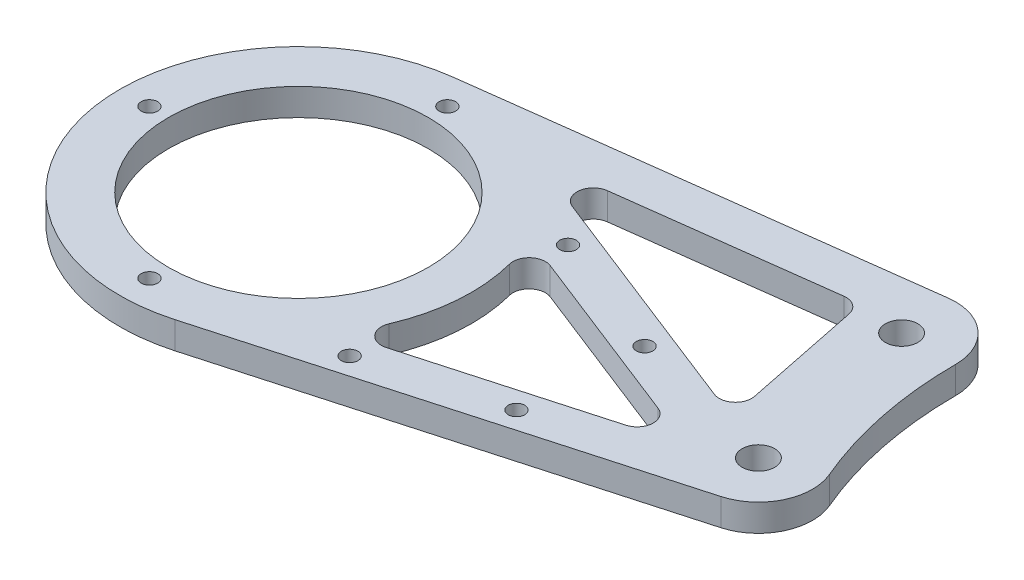
ISO-10303-21;
HEADER;
FILE_DESCRIPTION(('STEP AP214'),'2;1');
FILE_NAME('part.step','',(''),(''),'','','');
FILE_SCHEMA(('AUTOMOTIVE_DESIGN { 1 0 10303 214 1 1 1 1 }'));
ENDSEC;
DATA;
#1=APPLICATION_CONTEXT('core data for automotive mechanical design processes');
#2=APPLICATION_PROTOCOL_DEFINITION('international standard','automotive_design',2000,#1);
#3=PRODUCT_CONTEXT('',#1,'mechanical');
#4=PRODUCT('Part','Part','',(#3));
#5=PRODUCT_RELATED_PRODUCT_CATEGORY('part','',(#4));
#6=PRODUCT_DEFINITION_FORMATION('','',#4);
#7=PRODUCT_DEFINITION_CONTEXT('part definition',#1,'design');
#8=PRODUCT_DEFINITION('design','',#6,#7);
#9=PRODUCT_DEFINITION_SHAPE('','',#8);
#10=(LENGTH_UNIT() NAMED_UNIT(*) SI_UNIT(.MILLI.,.METRE.));
#11=(NAMED_UNIT(*) PLANE_ANGLE_UNIT() SI_UNIT($,.RADIAN.));
#12=(NAMED_UNIT(*) SI_UNIT($,.STERADIAN.) SOLID_ANGLE_UNIT());
#13=UNCERTAINTY_MEASURE_WITH_UNIT(LENGTH_MEASURE(1.E-05),#10,'distance_accuracy_value','');
#14=(GEOMETRIC_REPRESENTATION_CONTEXT(3) GLOBAL_UNCERTAINTY_ASSIGNED_CONTEXT((#13)) GLOBAL_UNIT_ASSIGNED_CONTEXT((#10,
#11,#12)) REPRESENTATION_CONTEXT('',''));
#15=CARTESIAN_POINT('',(0.,0.,0.));
#16=DIRECTION('',(0.,0.,1.));
#17=DIRECTION('',(1.,0.,0.));
#18=AXIS2_PLACEMENT_3D('',#15,#16,#17);
#19=CARTESIAN_POINT('',(0.,5.,0.));
#20=DIRECTION('',(0.,1.,0.));
#21=DIRECTION('',(0.,0.,1.));
#22=AXIS2_PLACEMENT_3D('',#19,#20,#21);
#23=PLANE('',#22);
#24=CARTESIAN_POINT('',(0.,5.,-27.5221634078138));
#25=DIRECTION('',(0.,1.,0.));
#26=DIRECTION('',(0.,0.,1.));
#27=AXIS2_PLACEMENT_3D('',#24,#25,#26);
#28=CIRCLE('',#27,1.525);
#29=CARTESIAN_POINT('',(0.,5.,-25.9971634078138));
#30=VERTEX_POINT('',#29);
#31=EDGE_CURVE('E363',#30,#30,#28,.T.);
#32=ORIENTED_EDGE('',*,*,#31,.F.);
#33=EDGE_LOOP('',(#32));
#34=FACE_BOUND('',#33,.T.);
#35=CARTESIAN_POINT('',(33.3215348622938,5.,-16.496811603075));
#36=DIRECTION('',(0.,1.,0.));
#37=DIRECTION('',(0.,0.,1.));
#38=AXIS2_PLACEMENT_3D('',#35,#36,#37);
#39=CIRCLE('',#38,1.525);
#40=CARTESIAN_POINT('',(33.3215348622938,5.,-14.971811603075));
#41=VERTEX_POINT('',#40);
#42=EDGE_CURVE('E366',#41,#41,#39,.T.);
#43=ORIENTED_EDGE('',*,*,#42,.F.);
#44=EDGE_LOOP('',(#43));
#45=FACE_BOUND('',#44,.T.);
#46=CARTESIAN_POINT('',(-27.5221634078138,5.,0.));
#47=DIRECTION('',(0.,1.,0.));
#48=DIRECTION('',(0.,0.,1.));
#49=AXIS2_PLACEMENT_3D('',#46,#47,#48);
#50=CIRCLE('',#49,1.525);
#51=CARTESIAN_POINT('',(-27.5221634078138,5.,1.525));
#52=VERTEX_POINT('',#51);
#53=EDGE_CURVE('E369',#52,#52,#50,.T.);
#54=ORIENTED_EDGE('',*,*,#53,.F.);
#55=EDGE_LOOP('',(#54));
#56=FACE_BOUND('',#55,.T.);
#57=CARTESIAN_POINT('',(0.,5.,27.5221634078138));
#58=DIRECTION('',(0.,1.,0.));
#59=DIRECTION('',(0.,0.,1.));
#60=AXIS2_PLACEMENT_3D('',#57,#58,#59);
#61=CIRCLE('',#60,1.525);
#62=CARTESIAN_POINT('',(0.,5.,29.0471634078138));
#63=VERTEX_POINT('',#62);
#64=EDGE_CURVE('E372',#63,#63,#61,.T.);
#65=ORIENTED_EDGE('',*,*,#64,.F.);
#66=EDGE_LOOP('',(#65));
#67=FACE_BOUND('',#66,.T.);
#68=CARTESIAN_POINT('',(30.9017025254333,5.,21.4381076218142));
#69=DIRECTION('',(0.,1.,0.));
#70=DIRECTION('',(0.,0.,1.));
#71=AXIS2_PLACEMENT_3D('',#68,#69,#70);
#72=CIRCLE('',#71,1.52499999999999);
#73=CARTESIAN_POINT('',(30.9017025254333,5.,22.9631076218142));
#74=VERTEX_POINT('',#73);
#75=EDGE_CURVE('E375',#74,#74,#72,.T.);
#76=ORIENTED_EDGE('',*,*,#75,.F.);
#77=EDGE_LOOP('',(#76));
#78=FACE_BOUND('',#77,.T.);
#79=CARTESIAN_POINT('',(56.596303963621,5.,-7.3707432667154));
#80=DIRECTION('',(0.,1.,0.));
#81=DIRECTION('',(0.,0.,1.));
#82=AXIS2_PLACEMENT_3D('',#79,#80,#81);
#83=CIRCLE('',#82,1.525);
#84=CARTESIAN_POINT('',(56.596303963621,5.,-5.84574326671541));
#85=VERTEX_POINT('',#84);
#86=EDGE_CURVE('E378',#85,#85,#83,.T.);
#87=ORIENTED_EDGE('',*,*,#86,.F.);
#88=EDGE_LOOP('',(#87));
#89=FACE_BOUND('',#88,.T.);
#90=CARTESIAN_POINT('',(54.9690819907024,5.,14.6734017394612));
#91=DIRECTION('',(0.,1.,0.));
#92=DIRECTION('',(0.,0.,1.));
#93=AXIS2_PLACEMENT_3D('',#90,#91,#92);
#94=CIRCLE('',#93,1.525);
#95=CARTESIAN_POINT('',(54.9690819907024,5.,16.1984017394612));
#96=VERTEX_POINT('',#95);
#97=EDGE_CURVE('E381',#96,#96,#94,.T.);
#98=ORIENTED_EDGE('',*,*,#97,.F.);
#99=EDGE_LOOP('',(#98));
#100=FACE_BOUND('',#99,.T.);
#101=CARTESIAN_POINT('',(0.,5.,0.));
#102=DIRECTION('',(0.,1.,0.));
#103=DIRECTION('',(0.,0.,1.));
#104=AXIS2_PLACEMENT_3D('',#101,#102,#103);
#105=CIRCLE('',#104,24.);
#106=CARTESIAN_POINT('',(0.,5.,24.));
#107=VERTEX_POINT('',#106);
#108=EDGE_CURVE('E213',#107,#107,#105,.T.);
#109=ORIENTED_EDGE('',*,*,#108,.F.);
#110=EDGE_LOOP('',(#109));
#111=FACE_BOUND('',#110,.T.);
#112=CARTESIAN_POINT('',(163.242912543457,5.,-33.2121459215883));
#113=DIRECTION('',(0.,1.,0.));
#114=DIRECTION('',(0.,0.,1.));
#115=AXIS2_PLACEMENT_3D('',#112,#113,#114);
#116=CIRCLE('',#115,75.);
#117=CARTESIAN_POINT('',(88.2429125434574,5.,-33.2121459215884));
#118=VERTEX_POINT('',#117);
#119=CARTESIAN_POINT('',(94.2050485345244,5.,-3.90731128489274));
#120=VERTEX_POINT('',#119);
#121=EDGE_CURVE('E186',#118,#120,#116,.T.);
#122=ORIENTED_EDGE('',*,*,#121,.F.);
#123=CARTESIAN_POINT('',(78.2429125434574,5.,-33.2121459215884));
#124=DIRECTION('',(0.,1.,0.));
#125=DIRECTION('',(0.,0.,1.));
#126=AXIS2_PLACEMENT_3D('',#123,#124,#125);
#127=CIRCLE('',#126,9.99999999999999);
#128=CARTESIAN_POINT('',(76.9721406469134,5.,-43.131074229977));
#129=VERTEX_POINT('',#128);
#130=EDGE_CURVE('E196',#118,#129,#127,.T.);
#131=ORIENTED_EDGE('',*,*,#130,.T.);
#132=DIRECTION('',(0.991892830838866,0.,-0.127077189654403));
#133=VECTOR('',#132,1.);
#134=CARTESIAN_POINT('',(-4.19354725859528,5.,-32.7324634176826));
#135=LINE('',#134,#133);
#136=CARTESIAN_POINT('',(-4.19354725859528,5.,-32.7324634176826));
#137=VERTEX_POINT('',#136);
#138=EDGE_CURVE('E201',#137,#129,#135,.T.);
#139=ORIENTED_EDGE('',*,*,#138,.F.);
#140=CARTESIAN_POINT('',(0.,5.,0.));
#141=DIRECTION('',(0.,1.,0.));
#142=DIRECTION('',(0.,0.,1.));
#143=AXIS2_PLACEMENT_3D('',#140,#141,#142);
#144=CIRCLE('',#143,33.);
#145=CARTESIAN_POINT('',(8.92941176470588,5.,31.7689408941553));
#146=VERTEX_POINT('',#145);
#147=EDGE_CURVE('E217',#137,#146,#144,.T.);
#148=ORIENTED_EDGE('',*,*,#147,.T.);
#149=DIRECTION('',(0.962695178610766,0.,-0.270588235294118));
#150=VECTOR('',#149,1.);
#151=CARTESIAN_POINT('',(8.92941176470588,5.,31.7689408941553));
#152=LINE('',#151,#150);
#153=CARTESIAN_POINT('',(87.7058823529412,5.,9.62695178610766));
#154=VERTEX_POINT('',#153);
#155=EDGE_CURVE('E219',#146,#154,#152,.T.);
#156=ORIENTED_EDGE('',*,*,#155,.T.);
#157=CARTESIAN_POINT('',(85.,5.,0.));
#158=DIRECTION('',(0.,1.,0.));
#159=DIRECTION('',(0.,0.,1.));
#160=AXIS2_PLACEMENT_3D('',#157,#158,#159);
#161=CIRCLE('',#160,9.99999999999999);
#162=EDGE_CURVE('E205',#154,#120,#161,.T.);
#163=ORIENTED_EDGE('',*,*,#162,.T.);
#164=EDGE_LOOP('',(#122,#131,#139,#148,#156,#163));
#165=FACE_BOUND('',#164,.T.);
#166=CARTESIAN_POINT('',(85.,5.,0.));
#167=DIRECTION('',(0.,1.,0.));
#168=DIRECTION('',(0.,0.,1.));
#169=AXIS2_PLACEMENT_3D('',#166,#167,#168);
#170=CIRCLE('',#169,3.00000000000001);
#171=CARTESIAN_POINT('',(85.,5.,3.00000000000001));
#172=VERTEX_POINT('',#171);
#173=EDGE_CURVE('E222',#172,#172,#170,.T.);
#174=ORIENTED_EDGE('',*,*,#173,.F.);
#175=EDGE_LOOP('',(#174));
#176=FACE_BOUND('',#175,.T.);
#177=CARTESIAN_POINT('',(78.2429125434574,5.,-33.2121459215884));
#178=DIRECTION('',(0.,1.,0.));
#179=DIRECTION('',(0.,0.,1.));
#180=AXIS2_PLACEMENT_3D('',#177,#178,#179);
#181=CIRCLE('',#180,3.00000000000002);
#182=CARTESIAN_POINT('',(78.2429125434574,5.,-30.2121459215883));
#183=VERTEX_POINT('',#182);
#184=EDGE_CURVE('E225',#183,#183,#181,.T.);
#185=ORIENTED_EDGE('',*,*,#184,.F.);
#186=EDGE_LOOP('',(#185));
#187=FACE_BOUND('',#186,.T.);
#188=DIRECTION('',(-0.930990764053088,0.,-0.365042733454383));
#189=VECTOR('',#188,1.);
#190=CARTESIAN_POINT('',(11.5069366947841,5.,-29.3468429956469));
#191=LINE('',#190,#189);
#192=CARTESIAN_POINT('',(70.7471802784156,5.,-6.11866363742589));
#193=VERTEX_POINT('',#192);
#194=CARTESIAN_POINT('',(27.5492275878876,5.,-23.056639113286));
#195=VERTEX_POINT('',#194);
#196=EDGE_CURVE('E324',#193,#195,#191,.T.);
#197=ORIENTED_EDGE('',*,*,#196,.T.);
#198=CARTESIAN_POINT('',(28.6443557882508,5.,-25.8496114054452));
#199=DIRECTION('',(0.,1.,0.));
#200=DIRECTION('',(0.,0.,1.));
#201=AXIS2_PLACEMENT_3D('',#198,#199,#200);
#202=CIRCLE('',#201,3.);
#203=CARTESIAN_POINT('',(28.2631242192876,5.,-28.8252898979618));
#204=VERTEX_POINT('',#203);
#205=EDGE_CURVE('E315',#195,#204,#202,.F.);
#206=ORIENTED_EDGE('',*,*,#205,.T.);
#207=DIRECTION('',(0.991892830838866,0.,-0.127077189654402));
#208=VECTOR('',#207,1.);
#209=CARTESIAN_POINT('',(-3.17692974136006,5.,-24.7973207709716));
#210=LINE('',#209,#208);
#211=CARTESIAN_POINT('',(67.0051772793221,5.,-33.7887608206695));
#212=VERTEX_POINT('',#211);
#213=EDGE_CURVE('E330',#204,#212,#210,.T.);
#214=ORIENTED_EDGE('',*,*,#213,.T.);
#215=CARTESIAN_POINT('',(67.3864088482853,5.,-30.8130823281529));
#216=DIRECTION('',(0.,1.,0.));
#217=DIRECTION('',(0.,0.,1.));
#218=AXIS2_PLACEMENT_3D('',#215,#216,#217);
#219=CIRCLE('',#218,3.);
#220=CARTESIAN_POINT('',(70.3261829621477,5.,-31.4111861314045));
#221=VERTEX_POINT('',#220);
#222=EDGE_CURVE('E79',#212,#221,#219,.F.);
#223=ORIENTED_EDGE('',*,*,#222,.T.);
#224=DIRECTION('',(0.199367934417198,0.,0.979924704620829));
#225=VECTOR('',#224,1.);
#226=CARTESIAN_POINT('',(73.6675519539497,5.,-14.9878328379459));
#227=LINE('',#226,#225);
#228=CARTESIAN_POINT('',(74.7820825926413,5.,-9.50973973283677));
#229=VERTEX_POINT('',#228);
#230=EDGE_CURVE('E325',#221,#229,#227,.T.);
#231=ORIENTED_EDGE('',*,*,#230,.T.);
#232=CARTESIAN_POINT('',(71.8423084787788,5.,-8.91163592958517));
#233=DIRECTION('',(0.,1.,0.));
#234=DIRECTION('',(0.,0.,1.));
#235=AXIS2_PLACEMENT_3D('',#232,#233,#234);
#236=CIRCLE('',#235,3.);
#237=EDGE_CURVE('E65',#229,#193,#236,.F.);
#238=ORIENTED_EDGE('',*,*,#237,.T.);
#239=EDGE_LOOP('',(#197,#206,#214,#223,#231,#238));
#240=FACE_BOUND('',#239,.T.);
#241=DIRECTION('',(0.962695178610766,0.,-0.270588235294118));
#242=VECTOR('',#241,1.);
#243=CARTESIAN_POINT('',(6.76470588235294,5.,24.0673794652692));
#244=LINE('',#243,#242);
#245=CARTESIAN_POINT('',(32.9705347593037,5.,16.7016118289686));
#246=VERTEX_POINT('',#245);
#247=CARTESIAN_POINT('',(67.5044798398151,5.,6.99503028093982));
#248=VERTEX_POINT('',#247);
#249=EDGE_CURVE('E357',#246,#248,#244,.T.);
#250=ORIENTED_EDGE('',*,*,#249,.F.);
#251=CARTESIAN_POINT('',(32.1587700534214,5.,13.8135262931363));
#252=DIRECTION('',(0.,1.,0.));
#253=DIRECTION('',(0.,0.,1.));
#254=AXIS2_PLACEMENT_3D('',#251,#252,#253);
#255=CIRCLE('',#254,3.);
#256=CARTESIAN_POINT('',(29.4023040488424,5.,12.6295097537246));
#257=VERTEX_POINT('',#256);
#258=EDGE_CURVE('E311',#246,#257,#255,.F.);
#259=ORIENTED_EDGE('',*,*,#258,.T.);
#260=CARTESIAN_POINT('',(0.,5.,0.));
#261=DIRECTION('',(0.,1.,0.));
#262=DIRECTION('',(0.,0.,1.));
#263=AXIS2_PLACEMENT_3D('',#260,#261,#262);
#264=CIRCLE('',#263,32.);
#265=CARTESIAN_POINT('',(30.9823975337499,5.,-8.0056881690889));
#266=VERTEX_POINT('',#265);
#267=EDGE_CURVE('E360',#257,#266,#264,.T.);
#268=ORIENTED_EDGE('',*,*,#267,.T.);
#269=CARTESIAN_POINT('',(33.8869973025389,5.,-8.75622143494099));
#270=DIRECTION('',(0.,1.,0.));
#271=DIRECTION('',(0.,0.,1.));
#272=AXIS2_PLACEMENT_3D('',#269,#270,#271);
#273=CIRCLE('',#272,3.);
#274=CARTESIAN_POINT('',(34.9821255029021,5.,-11.5491937271002));
#275=VERTEX_POINT('',#274);
#276=EDGE_CURVE('E303',#266,#275,#273,.F.);
#277=ORIENTED_EDGE('',*,*,#276,.T.);
#278=DIRECTION('',(0.930990764053088,0.,0.365042733454383));
#279=VECTOR('',#278,1.);
#280=CARTESIAN_POINT('',(8.58659482714902,5.,-21.8989168832222));
#281=LINE('',#280,#279);
#282=CARTESIAN_POINT('',(67.7878433342959,5.,1.31397245294826));
#283=VERTEX_POINT('',#282);
#284=EDGE_CURVE('E352',#275,#283,#281,.T.);
#285=ORIENTED_EDGE('',*,*,#284,.T.);
#286=CARTESIAN_POINT('',(66.6927151339328,5.,4.10694474510753));
#287=DIRECTION('',(0.,1.,0.));
#288=DIRECTION('',(0.,0.,1.));
#289=AXIS2_PLACEMENT_3D('',#286,#287,#288);
#290=CIRCLE('',#289,3.);
#291=EDGE_CURVE('E307',#283,#248,#290,.F.);
#292=ORIENTED_EDGE('',*,*,#291,.T.);
#293=EDGE_LOOP('',(#250,#259,#268,#277,#285,#292));
#294=FACE_BOUND('',#293,.T.);
#295=ADVANCED_FACE('F57',(#34,#45,#56,#67,#78,#89,#100,#111,#165,#176,#187,#240,#294),#23,.T.);
#296=CARTESIAN_POINT('',(0.,0.,0.));
#297=DIRECTION('',(0.,1.,0.));
#298=DIRECTION('',(0.,0.,1.));
#299=AXIS2_PLACEMENT_3D('',#296,#297,#298);
#300=PLANE('',#299);
#301=CARTESIAN_POINT('',(0.,0.,-27.5221634078138));
#302=DIRECTION('',(0.,-1.,0.));
#303=DIRECTION('',(0.,0.,-1.));
#304=AXIS2_PLACEMENT_3D('',#301,#302,#303);
#305=CIRCLE('',#304,1.525);
#306=CARTESIAN_POINT('',(0.,0.,-29.0471634078138));
#307=VERTEX_POINT('',#306);
#308=EDGE_CURVE('E384',#307,#307,#305,.T.);
#309=ORIENTED_EDGE('',*,*,#308,.F.);
#310=EDGE_LOOP('',(#309));
#311=FACE_BOUND('',#310,.T.);
#312=CARTESIAN_POINT('',(33.3215348622938,0.,-16.496811603075));
#313=DIRECTION('',(0.,-1.,0.));
#314=DIRECTION('',(0.,0.,-1.));
#315=AXIS2_PLACEMENT_3D('',#312,#313,#314);
#316=CIRCLE('',#315,1.525);
#317=CARTESIAN_POINT('',(33.3215348622938,0.,-18.021811603075));
#318=VERTEX_POINT('',#317);
#319=EDGE_CURVE('E400',#318,#318,#316,.T.);
#320=ORIENTED_EDGE('',*,*,#319,.F.);
#321=EDGE_LOOP('',(#320));
#322=FACE_BOUND('',#321,.T.);
#323=CARTESIAN_POINT('',(-27.5221634078138,0.,0.));
#324=DIRECTION('',(0.,-1.,0.));
#325=DIRECTION('',(0.,0.,-1.));
#326=AXIS2_PLACEMENT_3D('',#323,#324,#325);
#327=CIRCLE('',#326,1.525);
#328=CARTESIAN_POINT('',(-27.5221634078138,0.,-1.525));
#329=VERTEX_POINT('',#328);
#330=EDGE_CURVE('E397',#329,#329,#327,.T.);
#331=ORIENTED_EDGE('',*,*,#330,.F.);
#332=EDGE_LOOP('',(#331));
#333=FACE_BOUND('',#332,.T.);
#334=CARTESIAN_POINT('',(0.,0.,27.5221634078138));
#335=DIRECTION('',(0.,-1.,0.));
#336=DIRECTION('',(0.,0.,-1.));
#337=AXIS2_PLACEMENT_3D('',#334,#335,#336);
#338=CIRCLE('',#337,1.525);
#339=CARTESIAN_POINT('',(0.,0.,25.9971634078138));
#340=VERTEX_POINT('',#339);
#341=EDGE_CURVE('E394',#340,#340,#338,.T.);
#342=ORIENTED_EDGE('',*,*,#341,.F.);
#343=EDGE_LOOP('',(#342));
#344=FACE_BOUND('',#343,.T.);
#345=CARTESIAN_POINT('',(30.9017025254333,0.,21.4381076218142));
#346=DIRECTION('',(0.,-1.,0.));
#347=DIRECTION('',(0.,0.,-1.));
#348=AXIS2_PLACEMENT_3D('',#345,#346,#347);
#349=CIRCLE('',#348,1.52499999999999);
#350=CARTESIAN_POINT('',(30.9017025254333,0.,19.9131076218142));
#351=VERTEX_POINT('',#350);
#352=EDGE_CURVE('E391',#351,#351,#349,.T.);
#353=ORIENTED_EDGE('',*,*,#352,.F.);
#354=EDGE_LOOP('',(#353));
#355=FACE_BOUND('',#354,.T.);
#356=CARTESIAN_POINT('',(56.596303963621,0.,-7.3707432667154));
#357=DIRECTION('',(0.,-1.,0.));
#358=DIRECTION('',(0.,0.,-1.));
#359=AXIS2_PLACEMENT_3D('',#356,#357,#358);
#360=CIRCLE('',#359,1.525);
#361=CARTESIAN_POINT('',(56.596303963621,0.,-8.8957432667154));
#362=VERTEX_POINT('',#361);
#363=EDGE_CURVE('E388',#362,#362,#360,.T.);
#364=ORIENTED_EDGE('',*,*,#363,.F.);
#365=EDGE_LOOP('',(#364));
#366=FACE_BOUND('',#365,.T.);
#367=CARTESIAN_POINT('',(54.9690819907024,0.,14.6734017394612));
#368=DIRECTION('',(0.,-1.,0.));
#369=DIRECTION('',(0.,0.,-1.));
#370=AXIS2_PLACEMENT_3D('',#367,#368,#369);
#371=CIRCLE('',#370,1.525);
#372=CARTESIAN_POINT('',(54.9690819907024,0.,13.1484017394612));
#373=VERTEX_POINT('',#372);
#374=EDGE_CURVE('E385',#373,#373,#371,.T.);
#375=ORIENTED_EDGE('',*,*,#374,.F.);
#376=EDGE_LOOP('',(#375));
#377=FACE_BOUND('',#376,.T.);
#378=DIRECTION('',(0.199367934417198,0.,0.979924704620829));
#379=VECTOR('',#378,1.);
#380=CARTESIAN_POINT('',(73.6675519539497,0.,-14.9878328379459));
#381=LINE('',#380,#379);
#382=CARTESIAN_POINT('',(70.3261829621477,0.,-31.4111861314045));
#383=VERTEX_POINT('',#382);
#384=CARTESIAN_POINT('',(74.7820825926413,0.,-9.50973973283677));
#385=VERTEX_POINT('',#384);
#386=EDGE_CURVE('E262',#383,#385,#381,.T.);
#387=ORIENTED_EDGE('',*,*,#386,.F.);
#388=CARTESIAN_POINT('',(67.3864088482853,0.,-30.8130823281529));
#389=DIRECTION('',(0.,1.,0.));
#390=DIRECTION('',(0.,0.,1.));
#391=AXIS2_PLACEMENT_3D('',#388,#389,#390);
#392=CIRCLE('',#391,3.);
#393=CARTESIAN_POINT('',(67.0051772793221,0.,-33.7887608206695));
#394=VERTEX_POINT('',#393);
#395=EDGE_CURVE('E320',#383,#394,#392,.T.);
#396=ORIENTED_EDGE('',*,*,#395,.T.);
#397=DIRECTION('',(0.991892830838866,0.,-0.127077189654402));
#398=VECTOR('',#397,1.);
#399=CARTESIAN_POINT('',(-3.17692974136006,0.,-24.7973207709716));
#400=LINE('',#399,#398);
#401=CARTESIAN_POINT('',(28.2631242192876,0.,-28.8252898979618));
#402=VERTEX_POINT('',#401);
#403=EDGE_CURVE('E192',#402,#394,#400,.T.);
#404=ORIENTED_EDGE('',*,*,#403,.F.);
#405=CARTESIAN_POINT('',(28.6443557882508,0.,-25.8496114054452));
#406=DIRECTION('',(0.,1.,0.));
#407=DIRECTION('',(0.,0.,1.));
#408=AXIS2_PLACEMENT_3D('',#405,#406,#407);
#409=CIRCLE('',#408,3.);
#410=CARTESIAN_POINT('',(27.5492275878876,0.,-23.056639113286));
#411=VERTEX_POINT('',#410);
#412=EDGE_CURVE('E317',#402,#411,#409,.T.);
#413=ORIENTED_EDGE('',*,*,#412,.T.);
#414=DIRECTION('',(-0.930990764053088,0.,-0.365042733454383));
#415=VECTOR('',#414,1.);
#416=CARTESIAN_POINT('',(11.5069366947841,0.,-29.3468429956469));
#417=LINE('',#416,#415);
#418=CARTESIAN_POINT('',(70.7471802784156,0.,-6.11866363742589));
#419=VERTEX_POINT('',#418);
#420=EDGE_CURVE('E259',#419,#411,#417,.T.);
#421=ORIENTED_EDGE('',*,*,#420,.F.);
#422=CARTESIAN_POINT('',(71.8423084787788,0.,-8.91163592958517));
#423=DIRECTION('',(0.,1.,0.));
#424=DIRECTION('',(0.,0.,1.));
#425=AXIS2_PLACEMENT_3D('',#422,#423,#424);
#426=CIRCLE('',#425,3.);
#427=EDGE_CURVE('E12',#419,#385,#426,.T.);
#428=ORIENTED_EDGE('',*,*,#427,.T.);
#429=EDGE_LOOP('',(#387,#396,#404,#413,#421,#428));
#430=FACE_BOUND('',#429,.T.);
#431=CARTESIAN_POINT('',(0.,0.,0.));
#432=DIRECTION('',(0.,1.,0.));
#433=DIRECTION('',(0.,0.,1.));
#434=AXIS2_PLACEMENT_3D('',#431,#432,#433);
#435=CIRCLE('',#434,24.);
#436=CARTESIAN_POINT('',(0.,0.,24.));
#437=VERTEX_POINT('',#436);
#438=EDGE_CURVE('E231',#437,#437,#435,.T.);
#439=ORIENTED_EDGE('',*,*,#438,.T.);
#440=EDGE_LOOP('',(#439));
#441=FACE_BOUND('',#440,.T.);
#442=CARTESIAN_POINT('',(163.242912543457,0.,-33.2121459215883));
#443=DIRECTION('',(0.,1.,0.));
#444=DIRECTION('',(0.,0.,1.));
#445=AXIS2_PLACEMENT_3D('',#442,#443,#444);
#446=CIRCLE('',#445,75.);
#447=CARTESIAN_POINT('',(88.2429125434574,0.,-33.2121459215884));
#448=VERTEX_POINT('',#447);
#449=CARTESIAN_POINT('',(94.2050485345244,0.,-3.90731128489274));
#450=VERTEX_POINT('',#449);
#451=EDGE_CURVE('E188',#448,#450,#446,.T.);
#452=ORIENTED_EDGE('',*,*,#451,.T.);
#453=CARTESIAN_POINT('',(85.,0.,0.));
#454=DIRECTION('',(0.,1.,0.));
#455=DIRECTION('',(0.,0.,1.));
#456=AXIS2_PLACEMENT_3D('',#453,#454,#455);
#457=CIRCLE('',#456,9.99999999999999);
#458=CARTESIAN_POINT('',(87.7058823529412,0.,9.62695178610766));
#459=VERTEX_POINT('',#458);
#460=EDGE_CURVE('E240',#459,#450,#457,.T.);
#461=ORIENTED_EDGE('',*,*,#460,.F.);
#462=DIRECTION('',(0.962695178610766,0.,-0.270588235294118));
#463=VECTOR('',#462,1.);
#464=CARTESIAN_POINT('',(8.92941176470588,0.,31.7689408941553));
#465=LINE('',#464,#463);
#466=CARTESIAN_POINT('',(8.92941176470588,0.,31.7689408941553));
#467=VERTEX_POINT('',#466);
#468=EDGE_CURVE('E238',#467,#459,#465,.T.);
#469=ORIENTED_EDGE('',*,*,#468,.F.);
#470=CARTESIAN_POINT('',(0.,0.,0.));
#471=DIRECTION('',(0.,1.,0.));
#472=DIRECTION('',(0.,0.,1.));
#473=AXIS2_PLACEMENT_3D('',#470,#471,#472);
#474=CIRCLE('',#473,33.);
#475=CARTESIAN_POINT('',(-4.19354725859528,0.,-32.7324634176826));
#476=VERTEX_POINT('',#475);
#477=EDGE_CURVE('E236',#476,#467,#474,.T.);
#478=ORIENTED_EDGE('',*,*,#477,.F.);
#479=DIRECTION('',(0.991892830838866,0.,-0.127077189654403));
#480=VECTOR('',#479,1.);
#481=CARTESIAN_POINT('',(-4.19354725859528,0.,-32.7324634176826));
#482=LINE('',#481,#480);
#483=CARTESIAN_POINT('',(76.9721406469134,0.,-43.131074229977));
#484=VERTEX_POINT('',#483);
#485=EDGE_CURVE('E233',#476,#484,#482,.T.);
#486=ORIENTED_EDGE('',*,*,#485,.T.);
#487=CARTESIAN_POINT('',(78.2429125434574,0.,-33.2121459215884));
#488=DIRECTION('',(0.,1.,0.));
#489=DIRECTION('',(0.,0.,1.));
#490=AXIS2_PLACEMENT_3D('',#487,#488,#489);
#491=CIRCLE('',#490,9.99999999999999);
#492=EDGE_CURVE('E230',#448,#484,#491,.T.);
#493=ORIENTED_EDGE('',*,*,#492,.F.);
#494=EDGE_LOOP('',(#452,#461,#469,#478,#486,#493));
#495=FACE_BOUND('',#494,.T.);
#496=CARTESIAN_POINT('',(85.,0.,0.));
#497=DIRECTION('',(0.,1.,0.));
#498=DIRECTION('',(0.,0.,1.));
#499=AXIS2_PLACEMENT_3D('',#496,#497,#498);
#500=CIRCLE('',#499,3.00000000000001);
#501=CARTESIAN_POINT('',(85.,0.,3.00000000000001));
#502=VERTEX_POINT('',#501);
#503=EDGE_CURVE('E210',#502,#502,#500,.T.);
#504=ORIENTED_EDGE('',*,*,#503,.T.);
#505=EDGE_LOOP('',(#504));
#506=FACE_BOUND('',#505,.T.);
#507=CARTESIAN_POINT('',(78.2429125434574,0.,-33.2121459215884));
#508=DIRECTION('',(0.,1.,0.));
#509=DIRECTION('',(0.,0.,1.));
#510=AXIS2_PLACEMENT_3D('',#507,#508,#509);
#511=CIRCLE('',#510,3.00000000000002);
#512=CARTESIAN_POINT('',(78.2429125434574,0.,-30.2121459215883));
#513=VERTEX_POINT('',#512);
#514=EDGE_CURVE('E207',#513,#513,#511,.T.);
#515=ORIENTED_EDGE('',*,*,#514,.T.);
#516=EDGE_LOOP('',(#515));
#517=FACE_BOUND('',#516,.T.);
#518=CARTESIAN_POINT('',(0.,0.,0.));
#519=DIRECTION('',(0.,1.,0.));
#520=DIRECTION('',(0.,0.,1.));
#521=AXIS2_PLACEMENT_3D('',#518,#519,#520);
#522=CIRCLE('',#521,32.);
#523=CARTESIAN_POINT('',(29.4023040488424,0.,12.6295097537246));
#524=VERTEX_POINT('',#523);
#525=CARTESIAN_POINT('',(30.9823975337499,0.,-8.0056881690889));
#526=VERTEX_POINT('',#525);
#527=EDGE_CURVE('E271',#524,#526,#522,.T.);
#528=ORIENTED_EDGE('',*,*,#527,.F.);
#529=CARTESIAN_POINT('',(32.1587700534214,0.,13.8135262931363));
#530=DIRECTION('',(0.,1.,0.));
#531=DIRECTION('',(0.,0.,1.));
#532=AXIS2_PLACEMENT_3D('',#529,#530,#531);
#533=CIRCLE('',#532,3.);
#534=CARTESIAN_POINT('',(32.9705347593037,0.,16.7016118289686));
#535=VERTEX_POINT('',#534);
#536=EDGE_CURVE('E313',#524,#535,#533,.T.);
#537=ORIENTED_EDGE('',*,*,#536,.T.);
#538=DIRECTION('',(0.962695178610766,0.,-0.270588235294118));
#539=VECTOR('',#538,1.);
#540=CARTESIAN_POINT('',(6.76470588235294,0.,24.0673794652692));
#541=LINE('',#540,#539);
#542=CARTESIAN_POINT('',(67.5044798398151,0.,6.99503028093982));
#543=VERTEX_POINT('',#542);
#544=EDGE_CURVE('E265',#535,#543,#541,.T.);
#545=ORIENTED_EDGE('',*,*,#544,.T.);
#546=CARTESIAN_POINT('',(66.6927151339328,0.,4.10694474510753));
#547=DIRECTION('',(0.,1.,0.));
#548=DIRECTION('',(0.,0.,1.));
#549=AXIS2_PLACEMENT_3D('',#546,#547,#548);
#550=CIRCLE('',#549,3.);
#551=CARTESIAN_POINT('',(67.7878433342959,0.,1.31397245294826));
#552=VERTEX_POINT('',#551);
#553=EDGE_CURVE('E309',#543,#552,#550,.T.);
#554=ORIENTED_EDGE('',*,*,#553,.T.);
#555=DIRECTION('',(0.930990764053088,0.,0.365042733454383));
#556=VECTOR('',#555,1.);
#557=CARTESIAN_POINT('',(8.58659482714902,0.,-21.8989168832222));
#558=LINE('',#557,#556);
#559=CARTESIAN_POINT('',(34.9821255029021,0.,-11.5491937271002));
#560=VERTEX_POINT('',#559);
#561=EDGE_CURVE('E268',#560,#552,#558,.T.);
#562=ORIENTED_EDGE('',*,*,#561,.F.);
#563=CARTESIAN_POINT('',(33.8869973025389,0.,-8.75622143494099));
#564=DIRECTION('',(0.,1.,0.));
#565=DIRECTION('',(0.,0.,1.));
#566=AXIS2_PLACEMENT_3D('',#563,#564,#565);
#567=CIRCLE('',#566,3.);
#568=EDGE_CURVE('E305',#560,#526,#567,.T.);
#569=ORIENTED_EDGE('',*,*,#568,.T.);
#570=EDGE_LOOP('',(#528,#537,#545,#554,#562,#569));
#571=FACE_BOUND('',#570,.T.);
#572=ADVANCED_FACE('F334',(#311,#322,#333,#344,#355,#366,#377,#430,#441,#495,#506,#517,#571),
#300,.F.);
#573=CARTESIAN_POINT('',(163.242912543457,5.,-33.2121459215883));
#574=DIRECTION('',(0.,-1.,0.));
#575=DIRECTION('',(0.,0.,-1.));
#576=AXIS2_PLACEMENT_3D('',#573,#574,#575);
#577=CYLINDRICAL_SURFACE('',#576,75.);
#578=ORIENTED_EDGE('',*,*,#451,.F.);
#579=DIRECTION('',(0.,-1.,0.));
#580=VECTOR('',#579,1.);
#581=CARTESIAN_POINT('',(88.2429125434574,5.,-33.2121459215884));
#582=LINE('',#581,#580);
#583=EDGE_CURVE('E182',#118,#448,#582,.T.);
#584=ORIENTED_EDGE('',*,*,#583,.F.);
#585=ORIENTED_EDGE('',*,*,#121,.T.);
#586=DIRECTION('',(0.,-1.,0.));
#587=VECTOR('',#586,1.);
#588=CARTESIAN_POINT('',(94.2050485345244,5.,-3.90731128489274));
#589=LINE('',#588,#587);
#590=EDGE_CURVE('E228',#120,#450,#589,.T.);
#591=ORIENTED_EDGE('',*,*,#590,.T.);
#592=EDGE_LOOP('',(#578,#584,#585,#591));
#593=FACE_BOUND('',#592,.T.);
#594=ADVANCED_FACE('F184',(#593),#577,.F.);
#595=CARTESIAN_POINT('',(78.2429125434574,5.,-33.2121459215884));
#596=DIRECTION('',(0.,-1.,0.));
#597=DIRECTION('',(0.,0.,-1.));
#598=AXIS2_PLACEMENT_3D('',#595,#596,#597);
#599=CYLINDRICAL_SURFACE('',#598,9.99999999999999);
#600=ORIENTED_EDGE('',*,*,#492,.T.);
#601=DIRECTION('',(0.,-1.,0.));
#602=VECTOR('',#601,1.);
#603=CARTESIAN_POINT('',(76.9721406469134,5.,-43.131074229977));
#604=LINE('',#603,#602);
#605=EDGE_CURVE('E193',#129,#484,#604,.T.);
#606=ORIENTED_EDGE('',*,*,#605,.F.);
#607=ORIENTED_EDGE('',*,*,#130,.F.);
#608=ORIENTED_EDGE('',*,*,#583,.T.);
#609=EDGE_LOOP('',(#600,#606,#607,#608));
#610=FACE_BOUND('',#609,.T.);
#611=ADVANCED_FACE('F197',(#610),#599,.T.);
#612=CARTESIAN_POINT('',(-4.19354725859528,5.,-32.7324634176826));
#613=DIRECTION('',(-0.127077189654403,0.,-0.991892830838866));
#614=DIRECTION('',(-0.991892830838866,0.,0.127077189654403));
#615=AXIS2_PLACEMENT_3D('',#612,#613,#614);
#616=PLANE('',#615);
#617=ORIENTED_EDGE('',*,*,#485,.F.);
#618=DIRECTION('',(0.,-1.,0.));
#619=VECTOR('',#618,1.);
#620=CARTESIAN_POINT('',(-4.19354725859528,5.,-32.7324634176826));
#621=LINE('',#620,#619);
#622=EDGE_CURVE('E252',#137,#476,#621,.T.);
#623=ORIENTED_EDGE('',*,*,#622,.F.);
#624=ORIENTED_EDGE('',*,*,#138,.T.);
#625=ORIENTED_EDGE('',*,*,#605,.T.);
#626=EDGE_LOOP('',(#617,#623,#624,#625));
#627=FACE_BOUND('',#626,.T.);
#628=ADVANCED_FACE('F466',(#627),#616,.T.);
#629=CARTESIAN_POINT('',(0.,5.,0.));
#630=DIRECTION('',(0.,-1.,0.));
#631=DIRECTION('',(0.,0.,-1.));
#632=AXIS2_PLACEMENT_3D('',#629,#630,#631);
#633=CYLINDRICAL_SURFACE('',#632,33.);
#634=ORIENTED_EDGE('',*,*,#477,.T.);
#635=DIRECTION('',(0.,-1.,0.));
#636=VECTOR('',#635,1.);
#637=CARTESIAN_POINT('',(8.92941176470588,5.,31.7689408941553));
#638=LINE('',#637,#636);
#639=EDGE_CURVE('E249',#146,#467,#638,.T.);
#640=ORIENTED_EDGE('',*,*,#639,.F.);
#641=ORIENTED_EDGE('',*,*,#147,.F.);
#642=ORIENTED_EDGE('',*,*,#622,.T.);
#643=EDGE_LOOP('',(#634,#640,#641,#642));
#644=FACE_BOUND('',#643,.T.);
#645=ADVANCED_FACE('F462',(#644),#633,.T.);
#646=CARTESIAN_POINT('',(8.92941176470588,5.,31.7689408941553));
#647=DIRECTION('',(-0.270588235294118,0.,-0.962695178610766));
#648=DIRECTION('',(-0.962695178610766,0.,0.270588235294118));
#649=AXIS2_PLACEMENT_3D('',#646,#647,#648);
#650=PLANE('',#649);
#651=ORIENTED_EDGE('',*,*,#468,.T.);
#652=DIRECTION('',(0.,-1.,0.));
#653=VECTOR('',#652,1.);
#654=CARTESIAN_POINT('',(87.7058823529412,5.,9.62695178610766));
#655=LINE('',#654,#653);
#656=EDGE_CURVE('E246',#154,#459,#655,.T.);
#657=ORIENTED_EDGE('',*,*,#656,.F.);
#658=ORIENTED_EDGE('',*,*,#155,.F.);
#659=ORIENTED_EDGE('',*,*,#639,.T.);
#660=EDGE_LOOP('',(#651,#657,#658,#659));
#661=FACE_BOUND('',#660,.T.);
#662=ADVANCED_FACE('F455',(#661),#650,.F.);
#663=CARTESIAN_POINT('',(85.,5.,0.));
#664=DIRECTION('',(0.,-1.,0.));
#665=DIRECTION('',(0.,0.,-1.));
#666=AXIS2_PLACEMENT_3D('',#663,#664,#665);
#667=CYLINDRICAL_SURFACE('',#666,3.00000000000001);
#668=ORIENTED_EDGE('',*,*,#173,.T.);
#669=EDGE_LOOP('',(#668));
#670=FACE_BOUND('',#669,.T.);
#671=ORIENTED_EDGE('',*,*,#503,.F.);
#672=EDGE_LOOP('',(#671));
#673=FACE_BOUND('',#672,.T.);
#674=ADVANCED_FACE('F452',(#670,#673),#667,.F.);
#675=CARTESIAN_POINT('',(85.,5.,0.));
#676=DIRECTION('',(0.,-1.,0.));
#677=DIRECTION('',(0.,0.,-1.));
#678=AXIS2_PLACEMENT_3D('',#675,#676,#677);
#679=CYLINDRICAL_SURFACE('',#678,9.99999999999999);
#680=ORIENTED_EDGE('',*,*,#460,.T.);
#681=ORIENTED_EDGE('',*,*,#590,.F.);
#682=ORIENTED_EDGE('',*,*,#162,.F.);
#683=ORIENTED_EDGE('',*,*,#656,.T.);
#684=EDGE_LOOP('',(#680,#681,#682,#683));
#685=FACE_BOUND('',#684,.T.);
#686=ADVANCED_FACE('F450',(#685),#679,.T.);
#687=CARTESIAN_POINT('',(78.2429125434574,5.,-33.2121459215884));
#688=DIRECTION('',(0.,-1.,0.));
#689=DIRECTION('',(0.,0.,-1.));
#690=AXIS2_PLACEMENT_3D('',#687,#688,#689);
#691=CYLINDRICAL_SURFACE('',#690,3.00000000000002);
#692=ORIENTED_EDGE('',*,*,#184,.T.);
#693=EDGE_LOOP('',(#692));
#694=FACE_BOUND('',#693,.T.);
#695=ORIENTED_EDGE('',*,*,#514,.F.);
#696=EDGE_LOOP('',(#695));
#697=FACE_BOUND('',#696,.T.);
#698=ADVANCED_FACE('F447',(#694,#697),#691,.F.);
#699=CARTESIAN_POINT('',(0.,-5.,0.));
#700=DIRECTION('',(0.,1.,0.));
#701=DIRECTION('',(0.,0.,1.));
#702=AXIS2_PLACEMENT_3D('',#699,#700,#701);
#703=CYLINDRICAL_SURFACE('',#702,24.);
#704=ORIENTED_EDGE('',*,*,#108,.T.);
#705=EDGE_LOOP('',(#704));
#706=FACE_BOUND('',#705,.T.);
#707=ORIENTED_EDGE('',*,*,#438,.F.);
#708=EDGE_LOOP('',(#707));
#709=FACE_BOUND('',#708,.T.);
#710=ADVANCED_FACE('F444',(#706,#709),#703,.F.);
#711=CARTESIAN_POINT('',(73.6675519539497,-5.,-14.9878328379459));
#712=DIRECTION('',(-0.979924704620829,0.,0.199367934417198));
#713=DIRECTION('',(0.199367934417198,0.,0.979924704620829));
#714=AXIS2_PLACEMENT_3D('',#711,#712,#713);
#715=PLANE('',#714);
#716=ORIENTED_EDGE('',*,*,#230,.F.);
#717=DIRECTION('',(0.,1.,0.));
#718=VECTOR('',#717,1.);
#719=CARTESIAN_POINT('',(70.3261829621477,0.,-31.4111861314045));
#720=LINE('',#719,#718);
#721=EDGE_CURVE('E301',#221,#383,#720,.F.);
#722=ORIENTED_EDGE('',*,*,#721,.T.);
#723=ORIENTED_EDGE('',*,*,#386,.T.);
#724=DIRECTION('',(0.,1.,0.));
#725=VECTOR('',#724,1.);
#726=CARTESIAN_POINT('',(74.7820825926413,5.,-9.50973973283677));
#727=LINE('',#726,#725);
#728=EDGE_CURVE('E299',#385,#229,#727,.T.);
#729=ORIENTED_EDGE('',*,*,#728,.T.);
#730=EDGE_LOOP('',(#716,#722,#723,#729));
#731=FACE_BOUND('',#730,.T.);
#732=ADVANCED_FACE('F338',(#731),#715,.T.);
#733=CARTESIAN_POINT('',(11.5069366947841,-5.,-29.3468429956469));
#734=DIRECTION('',(0.365042733454383,0.,-0.930990764053088));
#735=DIRECTION('',(-0.930990764053088,0.,-0.365042733454383));
#736=AXIS2_PLACEMENT_3D('',#733,#734,#735);
#737=PLANE('',#736);
#738=ORIENTED_EDGE('',*,*,#420,.T.);
#739=DIRECTION('',(0.,1.,0.));
#740=VECTOR('',#739,1.);
#741=CARTESIAN_POINT('',(27.5492275878876,5.,-23.056639113286));
#742=LINE('',#741,#740);
#743=EDGE_CURVE('E291',#411,#195,#742,.T.);
#744=ORIENTED_EDGE('',*,*,#743,.T.);
#745=ORIENTED_EDGE('',*,*,#196,.F.);
#746=DIRECTION('',(0.,1.,0.));
#747=VECTOR('',#746,1.);
#748=CARTESIAN_POINT('',(70.7471802784156,0.,-6.1186636374259));
#749=LINE('',#748,#747);
#750=EDGE_CURVE('E289',#193,#419,#749,.F.);
#751=ORIENTED_EDGE('',*,*,#750,.T.);
#752=EDGE_LOOP('',(#738,#744,#745,#751));
#753=FACE_BOUND('',#752,.T.);
#754=ADVANCED_FACE('F327',(#753),#737,.T.);
#755=CARTESIAN_POINT('',(-3.17692974136006,-5.,-24.7973207709716));
#756=DIRECTION('',(0.127077189654402,0.,0.991892830838866));
#757=DIRECTION('',(0.991892830838866,0.,-0.127077189654402));
#758=AXIS2_PLACEMENT_3D('',#755,#756,#757);
#759=PLANE('',#758);
#760=ORIENTED_EDGE('',*,*,#213,.F.);
#761=DIRECTION('',(0.,1.,0.));
#762=VECTOR('',#761,1.);
#763=CARTESIAN_POINT('',(28.2631242192876,0.,-28.8252898979618));
#764=LINE('',#763,#762);
#765=EDGE_CURVE('E297',#204,#402,#764,.F.);
#766=ORIENTED_EDGE('',*,*,#765,.T.);
#767=ORIENTED_EDGE('',*,*,#403,.T.);
#768=DIRECTION('',(0.,1.,0.));
#769=VECTOR('',#768,1.);
#770=CARTESIAN_POINT('',(67.0051772793221,5.,-33.7887608206695));
#771=LINE('',#770,#769);
#772=EDGE_CURVE('E294',#394,#212,#771,.T.);
#773=ORIENTED_EDGE('',*,*,#772,.T.);
#774=EDGE_LOOP('',(#760,#766,#767,#773));
#775=FACE_BOUND('',#774,.T.);
#776=ADVANCED_FACE('F347',(#775),#759,.T.);
#777=CARTESIAN_POINT('',(0.,-5.,0.));
#778=DIRECTION('',(0.,1.,0.));
#779=DIRECTION('',(0.,0.,1.));
#780=AXIS2_PLACEMENT_3D('',#777,#778,#779);
#781=CYLINDRICAL_SURFACE('',#780,32.);
#782=ORIENTED_EDGE('',*,*,#527,.T.);
#783=DIRECTION('',(0.,1.,0.));
#784=VECTOR('',#783,1.);
#785=CARTESIAN_POINT('',(30.9823975337499,-5.,-8.0056881690889));
#786=LINE('',#785,#784);
#787=EDGE_CURVE('E276',#526,#266,#786,.T.);
#788=ORIENTED_EDGE('',*,*,#787,.T.);
#789=ORIENTED_EDGE('',*,*,#267,.F.);
#790=DIRECTION('',(0.,1.,0.));
#791=VECTOR('',#790,1.);
#792=CARTESIAN_POINT('',(29.4023040488424,-5.,12.6295097537246));
#793=LINE('',#792,#791);
#794=EDGE_CURVE('E274',#257,#524,#793,.F.);
#795=ORIENTED_EDGE('',*,*,#794,.T.);
#796=EDGE_LOOP('',(#782,#788,#789,#795));
#797=FACE_BOUND('',#796,.T.);
#798=ADVANCED_FACE('F619',(#797),#781,.T.);
#799=CARTESIAN_POINT('',(8.58659482714902,-5.,-21.8989168832222));
#800=DIRECTION('',(-0.365042733454383,0.,0.930990764053088));
#801=DIRECTION('',(0.930990764053088,0.,0.365042733454383));
#802=AXIS2_PLACEMENT_3D('',#799,#800,#801);
#803=PLANE('',#802);
#804=ORIENTED_EDGE('',*,*,#284,.F.);
#805=DIRECTION('',(0.,-1.,0.));
#806=VECTOR('',#805,1.);
#807=CARTESIAN_POINT('',(34.9821255029021,0.,-11.5491937271002));
#808=LINE('',#807,#806);
#809=EDGE_CURVE('E282',#275,#560,#808,.T.);
#810=ORIENTED_EDGE('',*,*,#809,.T.);
#811=ORIENTED_EDGE('',*,*,#561,.T.);
#812=DIRECTION('',(0.,1.,0.));
#813=VECTOR('',#812,1.);
#814=CARTESIAN_POINT('',(67.7878433342959,-5.,1.31397245294826));
#815=LINE('',#814,#813);
#816=EDGE_CURVE('E279',#552,#283,#815,.T.);
#817=ORIENTED_EDGE('',*,*,#816,.T.);
#818=EDGE_LOOP('',(#804,#810,#811,#817));
#819=FACE_BOUND('',#818,.T.);
#820=ADVANCED_FACE('F617',(#819),#803,.T.);
#821=CARTESIAN_POINT('',(6.76470588235294,-5.,24.0673794652692));
#822=DIRECTION('',(0.270588235294118,0.,0.962695178610766));
#823=DIRECTION('',(0.962695178610766,0.,-0.270588235294118));
#824=AXIS2_PLACEMENT_3D('',#821,#822,#823);
#825=PLANE('',#824);
#826=ORIENTED_EDGE('',*,*,#249,.T.);
#827=DIRECTION('',(0.,1.,0.));
#828=VECTOR('',#827,1.);
#829=CARTESIAN_POINT('',(67.5044798398151,-5.,6.99503028093982));
#830=LINE('',#829,#828);
#831=EDGE_CURVE('E287',#248,#543,#830,.F.);
#832=ORIENTED_EDGE('',*,*,#831,.T.);
#833=ORIENTED_EDGE('',*,*,#544,.F.);
#834=DIRECTION('',(0.,1.,0.));
#835=VECTOR('',#834,1.);
#836=CARTESIAN_POINT('',(32.9705347593037,-5.,16.7016118289686));
#837=LINE('',#836,#835);
#838=EDGE_CURVE('E284',#535,#246,#837,.T.);
#839=ORIENTED_EDGE('',*,*,#838,.T.);
#840=EDGE_LOOP('',(#826,#832,#833,#839));
#841=FACE_BOUND('',#840,.T.);
#842=ADVANCED_FACE('F479',(#841),#825,.F.);
#843=CARTESIAN_POINT('',(33.8869973025389,-5.,-8.75622143494099));
#844=DIRECTION('',(0.,1.,0.));
#845=DIRECTION('',(0.,0.,1.));
#846=AXIS2_PLACEMENT_3D('',#843,#844,#845);
#847=CYLINDRICAL_SURFACE('',#846,3.);
#848=ORIENTED_EDGE('',*,*,#568,.F.);
#849=ORIENTED_EDGE('',*,*,#809,.F.);
#850=ORIENTED_EDGE('',*,*,#276,.F.);
#851=ORIENTED_EDGE('',*,*,#787,.F.);
#852=EDGE_LOOP('',(#848,#849,#850,#851));
#853=FACE_BOUND('',#852,.T.);
#854=ADVANCED_FACE('F475',(#853),#847,.F.);
#855=CARTESIAN_POINT('',(66.6927151339328,-5.,4.10694474510753));
#856=DIRECTION('',(0.,1.,0.));
#857=DIRECTION('',(0.,0.,1.));
#858=AXIS2_PLACEMENT_3D('',#855,#856,#857);
#859=CYLINDRICAL_SURFACE('',#858,3.);
#860=ORIENTED_EDGE('',*,*,#553,.F.);
#861=ORIENTED_EDGE('',*,*,#831,.F.);
#862=ORIENTED_EDGE('',*,*,#291,.F.);
#863=ORIENTED_EDGE('',*,*,#816,.F.);
#864=EDGE_LOOP('',(#860,#861,#862,#863));
#865=FACE_BOUND('',#864,.T.);
#866=ADVANCED_FACE('F478',(#865),#859,.F.);
#867=CARTESIAN_POINT('',(32.1587700534214,-5.,13.8135262931363));
#868=DIRECTION('',(0.,1.,0.));
#869=DIRECTION('',(0.,0.,1.));
#870=AXIS2_PLACEMENT_3D('',#867,#868,#869);
#871=CYLINDRICAL_SURFACE('',#870,3.);
#872=ORIENTED_EDGE('',*,*,#536,.F.);
#873=ORIENTED_EDGE('',*,*,#794,.F.);
#874=ORIENTED_EDGE('',*,*,#258,.F.);
#875=ORIENTED_EDGE('',*,*,#838,.F.);
#876=EDGE_LOOP('',(#872,#873,#874,#875));
#877=FACE_BOUND('',#876,.T.);
#878=ADVANCED_FACE('F483',(#877),#871,.F.);
#879=CARTESIAN_POINT('',(28.6443557882508,-5.,-25.8496114054452));
#880=DIRECTION('',(0.,-1.,0.));
#881=DIRECTION('',(0.,0.,-1.));
#882=AXIS2_PLACEMENT_3D('',#879,#880,#881);
#883=CYLINDRICAL_SURFACE('',#882,3.);
#884=ORIENTED_EDGE('',*,*,#412,.F.);
#885=ORIENTED_EDGE('',*,*,#765,.F.);
#886=ORIENTED_EDGE('',*,*,#205,.F.);
#887=ORIENTED_EDGE('',*,*,#743,.F.);
#888=EDGE_LOOP('',(#884,#885,#886,#887));
#889=FACE_BOUND('',#888,.T.);
#890=ADVANCED_FACE('F350',(#889),#883,.F.);
#891=CARTESIAN_POINT('',(67.3864088482853,-5.,-30.8130823281529));
#892=DIRECTION('',(0.,-1.,0.));
#893=DIRECTION('',(0.,0.,-1.));
#894=AXIS2_PLACEMENT_3D('',#891,#892,#893);
#895=CYLINDRICAL_SURFACE('',#894,3.);
#896=ORIENTED_EDGE('',*,*,#395,.F.);
#897=ORIENTED_EDGE('',*,*,#721,.F.);
#898=ORIENTED_EDGE('',*,*,#222,.F.);
#899=ORIENTED_EDGE('',*,*,#772,.F.);
#900=EDGE_LOOP('',(#896,#897,#898,#899));
#901=FACE_BOUND('',#900,.T.);
#902=ADVANCED_FACE('F341',(#901),#895,.F.);
#903=CARTESIAN_POINT('',(71.8423084787788,-5.,-8.91163592958517));
#904=DIRECTION('',(0.,-1.,0.));
#905=DIRECTION('',(0.,0.,-1.));
#906=AXIS2_PLACEMENT_3D('',#903,#904,#905);
#907=CYLINDRICAL_SURFACE('',#906,3.);
#908=ORIENTED_EDGE('',*,*,#427,.F.);
#909=ORIENTED_EDGE('',*,*,#750,.F.);
#910=ORIENTED_EDGE('',*,*,#237,.F.);
#911=ORIENTED_EDGE('',*,*,#728,.F.);
#912=EDGE_LOOP('',(#908,#909,#910,#911));
#913=FACE_BOUND('',#912,.T.);
#914=ADVANCED_FACE('F59',(#913),#907,.F.);
#915=CARTESIAN_POINT('',(54.9690819907024,10.,14.6734017394612));
#916=DIRECTION('',(0.,-1.,0.));
#917=DIRECTION('',(0.,0.,-1.));
#918=AXIS2_PLACEMENT_3D('',#915,#916,#917);
#919=CYLINDRICAL_SURFACE('',#918,1.525);
#920=ORIENTED_EDGE('',*,*,#97,.T.);
#921=EDGE_LOOP('',(#920));
#922=FACE_BOUND('',#921,.T.);
#923=ORIENTED_EDGE('',*,*,#374,.T.);
#924=EDGE_LOOP('',(#923));
#925=FACE_BOUND('',#924,.T.);
#926=ADVANCED_FACE('F423',(#922,#925),#919,.F.);
#927=CARTESIAN_POINT('',(56.596303963621,10.,-7.3707432667154));
#928=DIRECTION('',(0.,-1.,0.));
#929=DIRECTION('',(0.,0.,-1.));
#930=AXIS2_PLACEMENT_3D('',#927,#928,#929);
#931=CYLINDRICAL_SURFACE('',#930,1.525);
#932=ORIENTED_EDGE('',*,*,#86,.T.);
#933=EDGE_LOOP('',(#932));
#934=FACE_BOUND('',#933,.T.);
#935=ORIENTED_EDGE('',*,*,#363,.T.);
#936=EDGE_LOOP('',(#935));
#937=FACE_BOUND('',#936,.T.);
#938=ADVANCED_FACE('F425',(#934,#937),#931,.F.);
#939=CARTESIAN_POINT('',(30.9017025254333,10.,21.4381076218142));
#940=DIRECTION('',(0.,-1.,0.));
#941=DIRECTION('',(0.,0.,-1.));
#942=AXIS2_PLACEMENT_3D('',#939,#940,#941);
#943=CYLINDRICAL_SURFACE('',#942,1.52499999999999);
#944=ORIENTED_EDGE('',*,*,#75,.T.);
#945=EDGE_LOOP('',(#944));
#946=FACE_BOUND('',#945,.T.);
#947=ORIENTED_EDGE('',*,*,#352,.T.);
#948=EDGE_LOOP('',(#947));
#949=FACE_BOUND('',#948,.T.);
#950=ADVANCED_FACE('F432',(#946,#949),#943,.F.);
#951=CARTESIAN_POINT('',(0.,10.,27.5221634078138));
#952=DIRECTION('',(0.,-1.,0.));
#953=DIRECTION('',(0.,0.,-1.));
#954=AXIS2_PLACEMENT_3D('',#951,#952,#953);
#955=CYLINDRICAL_SURFACE('',#954,1.525);
#956=ORIENTED_EDGE('',*,*,#64,.T.);
#957=EDGE_LOOP('',(#956));
#958=FACE_BOUND('',#957,.T.);
#959=ORIENTED_EDGE('',*,*,#341,.T.);
#960=EDGE_LOOP('',(#959));
#961=FACE_BOUND('',#960,.T.);
#962=ADVANCED_FACE('F531',(#958,#961),#955,.F.);
#963=CARTESIAN_POINT('',(-27.5221634078138,10.,0.));
#964=DIRECTION('',(0.,-1.,0.));
#965=DIRECTION('',(0.,0.,-1.));
#966=AXIS2_PLACEMENT_3D('',#963,#964,#965);
#967=CYLINDRICAL_SURFACE('',#966,1.525);
#968=ORIENTED_EDGE('',*,*,#53,.T.);
#969=EDGE_LOOP('',(#968));
#970=FACE_BOUND('',#969,.T.);
#971=ORIENTED_EDGE('',*,*,#330,.T.);
#972=EDGE_LOOP('',(#971));
#973=FACE_BOUND('',#972,.T.);
#974=ADVANCED_FACE('F541',(#970,#973),#967,.F.);
#975=CARTESIAN_POINT('',(33.3215348622938,10.,-16.496811603075));
#976=DIRECTION('',(0.,-1.,0.));
#977=DIRECTION('',(0.,0.,-1.));
#978=AXIS2_PLACEMENT_3D('',#975,#976,#977);
#979=CYLINDRICAL_SURFACE('',#978,1.525);
#980=ORIENTED_EDGE('',*,*,#42,.T.);
#981=EDGE_LOOP('',(#980));
#982=FACE_BOUND('',#981,.T.);
#983=ORIENTED_EDGE('',*,*,#319,.T.);
#984=EDGE_LOOP('',(#983));
#985=FACE_BOUND('',#984,.T.);
#986=ADVANCED_FACE('F551',(#982,#985),#979,.F.);
#987=CARTESIAN_POINT('',(0.,10.,-27.5221634078138));
#988=DIRECTION('',(0.,-1.,0.));
#989=DIRECTION('',(0.,0.,-1.));
#990=AXIS2_PLACEMENT_3D('',#987,#988,#989);
#991=CYLINDRICAL_SURFACE('',#990,1.525);
#992=ORIENTED_EDGE('',*,*,#31,.T.);
#993=EDGE_LOOP('',(#992));
#994=FACE_BOUND('',#993,.T.);
#995=ORIENTED_EDGE('',*,*,#308,.T.);
#996=EDGE_LOOP('',(#995));
#997=FACE_BOUND('',#996,.T.);
#998=ADVANCED_FACE('F406',(#994,#997),#991,.F.);
#999=CLOSED_SHELL('',(#295,#572,#594,#611,#628,#645,#662,#674,#686,#698,#710,#732,#754,#776,
#798,#820,#842,#854,#866,#878,#890,#902,#914,#926,#938,#950,#962,#974,#986,#998));
#1000=MANIFOLD_SOLID_BREP('B2',#999);
#1001=ADVANCED_BREP_SHAPE_REPRESENTATION('',(#18,#1000),#14);
#1002=SHAPE_DEFINITION_REPRESENTATION(#9,#1001);
ENDSEC;
END-ISO-10303-21;
